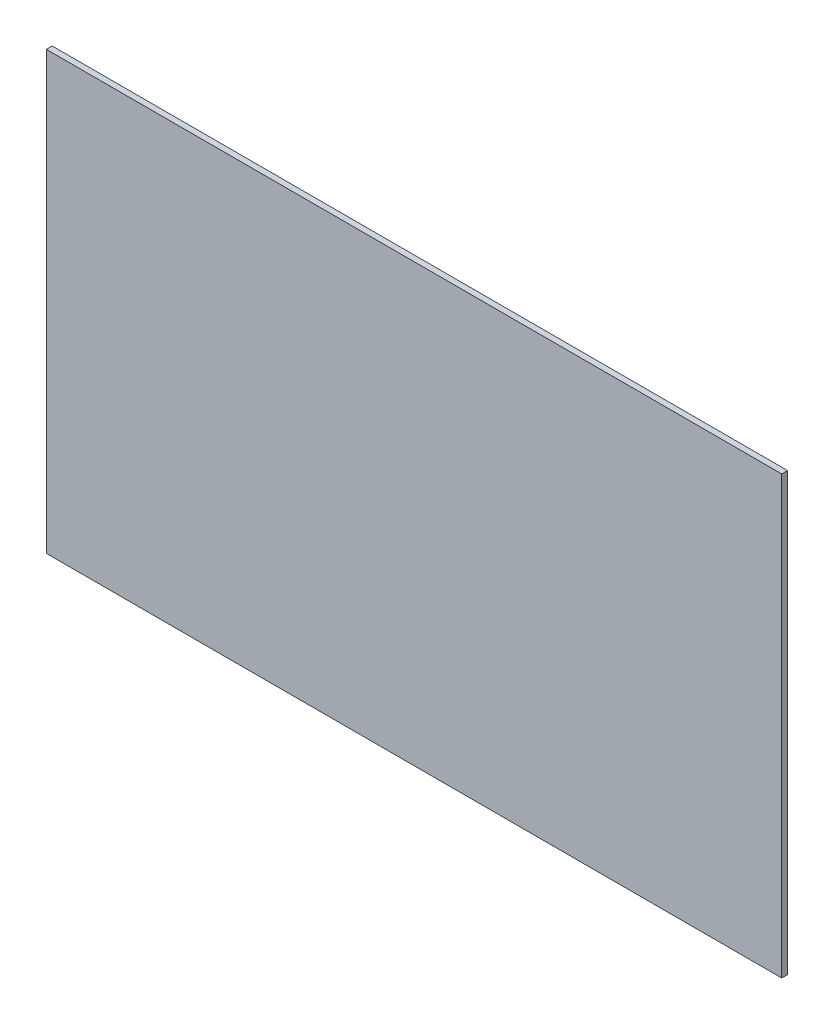
ISO-10303-21;
HEADER;
FILE_DESCRIPTION(('STEP AP214'),'2;1');
FILE_NAME('part.step','',(''),(''),'','','');
FILE_SCHEMA(('AUTOMOTIVE_DESIGN { 1 0 10303 214 1 1 1 1 }'));
ENDSEC;
DATA;
#1=APPLICATION_CONTEXT('core data for automotive mechanical design processes');
#2=APPLICATION_PROTOCOL_DEFINITION('international standard','automotive_design',2000,#1);
#3=PRODUCT_CONTEXT('',#1,'mechanical');
#4=PRODUCT('Part','Part','',(#3));
#5=PRODUCT_RELATED_PRODUCT_CATEGORY('part','',(#4));
#6=PRODUCT_DEFINITION_FORMATION('','',#4);
#7=PRODUCT_DEFINITION_CONTEXT('part definition',#1,'design');
#8=PRODUCT_DEFINITION('design','',#6,#7);
#9=PRODUCT_DEFINITION_SHAPE('','',#8);
#10=(LENGTH_UNIT() NAMED_UNIT(*) SI_UNIT(.MILLI.,.METRE.));
#11=(NAMED_UNIT(*) PLANE_ANGLE_UNIT() SI_UNIT($,.RADIAN.));
#12=(NAMED_UNIT(*) SI_UNIT($,.STERADIAN.) SOLID_ANGLE_UNIT());
#13=UNCERTAINTY_MEASURE_WITH_UNIT(LENGTH_MEASURE(1.E-05),#10,'distance_accuracy_value','');
#14=(GEOMETRIC_REPRESENTATION_CONTEXT(3) GLOBAL_UNCERTAINTY_ASSIGNED_CONTEXT((#13)) GLOBAL_UNIT_ASSIGNED_CONTEXT((#10,
#11,#12)) REPRESENTATION_CONTEXT('',''));
#15=CARTESIAN_POINT('',(0.,0.,0.));
#16=DIRECTION('',(0.,0.,1.));
#17=DIRECTION('',(1.,0.,0.));
#18=AXIS2_PLACEMENT_3D('',#15,#16,#17);
#19=CARTESIAN_POINT('',(8.275,-0.525,0.05));
#20=DIRECTION('',(-1.,0.,0.));
#21=DIRECTION('',(0.,0.,1.));
#22=AXIS2_PLACEMENT_3D('',#19,#20,#21);
#23=PLANE('',#22);
#24=DIRECTION('',(0.,0.,-1.));
#25=VECTOR('',#24,1.);
#26=CARTESIAN_POINT('',(8.275,-4.25,0.05));
#27=LINE('',#26,#25);
#28=CARTESIAN_POINT('',(8.275,-4.25,0.1));
#29=VERTEX_POINT('',#28);
#30=CARTESIAN_POINT('',(8.275,-4.25,0.));
#31=VERTEX_POINT('',#30);
#32=EDGE_CURVE('E20',#29,#31,#27,.T.);
#33=ORIENTED_EDGE('',*,*,#32,.T.);
#34=DIRECTION('',(0.,-1.,0.));
#35=VECTOR('',#34,1.);
#36=CARTESIAN_POINT('',(8.275,-0.525,0.));
#37=LINE('',#36,#35);
#38=CARTESIAN_POINT('',(8.275,3.2,0.));
#39=VERTEX_POINT('',#38);
#40=EDGE_CURVE('E85',#39,#31,#37,.T.);
#41=ORIENTED_EDGE('',*,*,#40,.F.);
#42=DIRECTION('',(0.,0.,-1.));
#43=VECTOR('',#42,1.);
#44=CARTESIAN_POINT('',(8.275,3.2,0.05));
#45=LINE('',#44,#43);
#46=CARTESIAN_POINT('',(8.275,3.2,0.1));
#47=VERTEX_POINT('',#46);
#48=EDGE_CURVE('E11',#47,#39,#45,.T.);
#49=ORIENTED_EDGE('',*,*,#48,.F.);
#50=DIRECTION('',(0.,1.,0.));
#51=VECTOR('',#50,1.);
#52=CARTESIAN_POINT('',(8.275,-0.525,0.1));
#53=LINE('',#52,#51);
#54=EDGE_CURVE('E82',#29,#47,#53,.T.);
#55=ORIENTED_EDGE('',*,*,#54,.F.);
#56=EDGE_LOOP('',(#33,#41,#49,#55));
#57=FACE_BOUND('',#56,.T.);
#58=ADVANCED_FACE('F16',(#57),#23,.F.);
#59=CARTESIAN_POINT('',(2.,3.2,0.05));
#60=DIRECTION('',(0.,-1.,0.));
#61=DIRECTION('',(0.,0.,-1.));
#62=AXIS2_PLACEMENT_3D('',#59,#60,#61);
#63=PLANE('',#62);
#64=ORIENTED_EDGE('',*,*,#48,.T.);
#65=DIRECTION('',(1.,0.,0.));
#66=VECTOR('',#65,1.);
#67=CARTESIAN_POINT('',(2.,3.2,0.));
#68=LINE('',#67,#66);
#69=CARTESIAN_POINT('',(-4.275,3.2,0.));
#70=VERTEX_POINT('',#69);
#71=EDGE_CURVE('E96',#70,#39,#68,.T.);
#72=ORIENTED_EDGE('',*,*,#71,.F.);
#73=DIRECTION('',(0.,0.,-1.));
#74=VECTOR('',#73,1.);
#75=CARTESIAN_POINT('',(-4.275,3.2,0.05));
#76=LINE('',#75,#74);
#77=CARTESIAN_POINT('',(-4.275,3.2,0.1));
#78=VERTEX_POINT('',#77);
#79=EDGE_CURVE('E27',#78,#70,#76,.T.);
#80=ORIENTED_EDGE('',*,*,#79,.F.);
#81=DIRECTION('',(-1.,0.,0.));
#82=VECTOR('',#81,1.);
#83=CARTESIAN_POINT('',(2.,3.2,0.1));
#84=LINE('',#83,#82);
#85=EDGE_CURVE('E88',#47,#78,#84,.T.);
#86=ORIENTED_EDGE('',*,*,#85,.F.);
#87=EDGE_LOOP('',(#64,#72,#80,#86));
#88=FACE_BOUND('',#87,.T.);
#89=ADVANCED_FACE('F117',(#88),#63,.F.);
#90=CARTESIAN_POINT('',(-4.275,-0.525,0.05));
#91=DIRECTION('',(1.,0.,0.));
#92=DIRECTION('',(0.,1.,0.));
#93=AXIS2_PLACEMENT_3D('',#90,#91,#92);
#94=PLANE('',#93);
#95=ORIENTED_EDGE('',*,*,#79,.T.);
#96=DIRECTION('',(0.,1.,0.));
#97=VECTOR('',#96,1.);
#98=CARTESIAN_POINT('',(-4.275,-0.525,0.));
#99=LINE('',#98,#97);
#100=CARTESIAN_POINT('',(-4.275,-4.25,0.));
#101=VERTEX_POINT('',#100);
#102=EDGE_CURVE('E99',#101,#70,#99,.T.);
#103=ORIENTED_EDGE('',*,*,#102,.F.);
#104=DIRECTION('',(0.,0.,-1.));
#105=VECTOR('',#104,1.);
#106=CARTESIAN_POINT('',(-4.275,-4.25,0.05));
#107=LINE('',#106,#105);
#108=CARTESIAN_POINT('',(-4.275,-4.25,0.1));
#109=VERTEX_POINT('',#108);
#110=EDGE_CURVE('E77',#109,#101,#107,.T.);
#111=ORIENTED_EDGE('',*,*,#110,.F.);
#112=DIRECTION('',(0.,-1.,0.));
#113=VECTOR('',#112,1.);
#114=CARTESIAN_POINT('',(-4.275,-0.525,0.1));
#115=LINE('',#114,#113);
#116=EDGE_CURVE('E83',#78,#109,#115,.T.);
#117=ORIENTED_EDGE('',*,*,#116,.F.);
#118=EDGE_LOOP('',(#95,#103,#111,#117));
#119=FACE_BOUND('',#118,.T.);
#120=ADVANCED_FACE('F119',(#119),#94,.F.);
#121=CARTESIAN_POINT('',(2.,-4.25,0.05));
#122=DIRECTION('',(0.,1.,0.));
#123=DIRECTION('',(1.,0.,0.));
#124=AXIS2_PLACEMENT_3D('',#121,#122,#123);
#125=PLANE('',#124);
#126=ORIENTED_EDGE('',*,*,#110,.T.);
#127=DIRECTION('',(-1.,0.,0.));
#128=VECTOR('',#127,1.);
#129=CARTESIAN_POINT('',(2.,-4.25,0.));
#130=LINE('',#129,#128);
#131=EDGE_CURVE('E71',#31,#101,#130,.T.);
#132=ORIENTED_EDGE('',*,*,#131,.F.);
#133=ORIENTED_EDGE('',*,*,#32,.F.);
#134=DIRECTION('',(1.,0.,0.));
#135=VECTOR('',#134,1.);
#136=CARTESIAN_POINT('',(2.,-4.25,0.1));
#137=LINE('',#136,#135);
#138=EDGE_CURVE('E68',#109,#29,#137,.T.);
#139=ORIENTED_EDGE('',*,*,#138,.F.);
#140=EDGE_LOOP('',(#126,#132,#133,#139));
#141=FACE_BOUND('',#140,.T.);
#142=ADVANCED_FACE('F67',(#141),#125,.F.);
#143=CARTESIAN_POINT('',(2.,-0.525,0.));
#144=DIRECTION('',(0.,0.,1.));
#145=DIRECTION('',(1.,0.,0.));
#146=AXIS2_PLACEMENT_3D('',#143,#144,#145);
#147=PLANE('',#146);
#148=ORIENTED_EDGE('',*,*,#40,.T.);
#149=ORIENTED_EDGE('',*,*,#131,.T.);
#150=ORIENTED_EDGE('',*,*,#102,.T.);
#151=ORIENTED_EDGE('',*,*,#71,.T.);
#152=EDGE_LOOP('',(#148,#149,#150,#151));
#153=FACE_BOUND('',#152,.T.);
#154=ADVANCED_FACE('F18',(#153),#147,.F.);
#155=CARTESIAN_POINT('',(2.,-0.525,0.1));
#156=DIRECTION('',(0.,0.,1.));
#157=DIRECTION('',(1.,0.,0.));
#158=AXIS2_PLACEMENT_3D('',#155,#156,#157);
#159=PLANE('',#158);
#160=ORIENTED_EDGE('',*,*,#54,.T.);
#161=ORIENTED_EDGE('',*,*,#85,.T.);
#162=ORIENTED_EDGE('',*,*,#116,.T.);
#163=ORIENTED_EDGE('',*,*,#138,.T.);
#164=EDGE_LOOP('',(#160,#161,#162,#163));
#165=FACE_BOUND('',#164,.T.);
#166=ADVANCED_FACE('F80',(#165),#159,.T.);
#167=CLOSED_SHELL('',(#58,#89,#120,#142,#154,#166));
#168=MANIFOLD_SOLID_BREP('B1',#167);
#169=ADVANCED_BREP_SHAPE_REPRESENTATION('',(#18,#168),#14);
#170=SHAPE_DEFINITION_REPRESENTATION(#9,#169);
ENDSEC;
END-ISO-10303-21;
